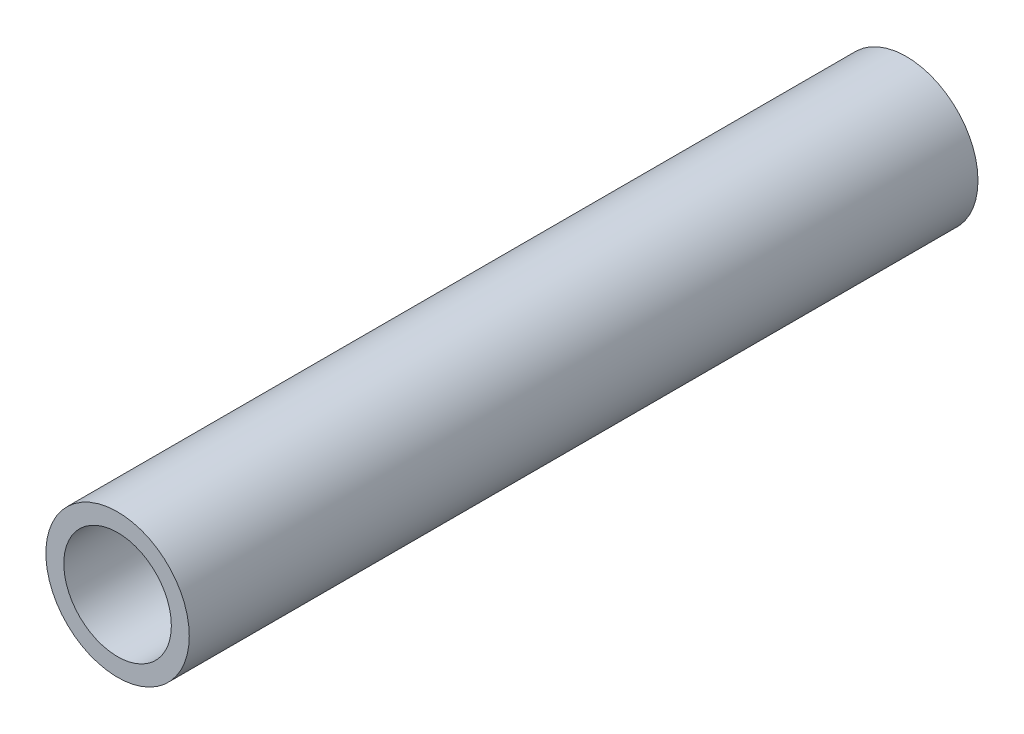
ISO-10303-21;
HEADER;
FILE_DESCRIPTION(('STEP AP214'),'2;1');
FILE_NAME('part.step','',(''),(''),'','','');
FILE_SCHEMA(('AUTOMOTIVE_DESIGN { 1 0 10303 214 1 1 1 1 }'));
ENDSEC;
DATA;
#1=APPLICATION_CONTEXT('core data for automotive mechanical design processes');
#2=APPLICATION_PROTOCOL_DEFINITION('international standard','automotive_design',2000,#1);
#3=PRODUCT_CONTEXT('',#1,'mechanical');
#4=PRODUCT('Part','Part','',(#3));
#5=PRODUCT_RELATED_PRODUCT_CATEGORY('part','',(#4));
#6=PRODUCT_DEFINITION_FORMATION('','',#4);
#7=PRODUCT_DEFINITION_CONTEXT('part definition',#1,'design');
#8=PRODUCT_DEFINITION('design','',#6,#7);
#9=PRODUCT_DEFINITION_SHAPE('','',#8);
#10=(LENGTH_UNIT() NAMED_UNIT(*) SI_UNIT(.MILLI.,.METRE.));
#11=(NAMED_UNIT(*) PLANE_ANGLE_UNIT() SI_UNIT($,.RADIAN.));
#12=(NAMED_UNIT(*) SI_UNIT($,.STERADIAN.) SOLID_ANGLE_UNIT());
#13=UNCERTAINTY_MEASURE_WITH_UNIT(LENGTH_MEASURE(1.E-05),#10,'distance_accuracy_value','');
#14=(GEOMETRIC_REPRESENTATION_CONTEXT(3) GLOBAL_UNCERTAINTY_ASSIGNED_CONTEXT((#13)) GLOBAL_UNIT_ASSIGNED_CONTEXT((#10,
#11,#12)) REPRESENTATION_CONTEXT('',''));
#15=CARTESIAN_POINT('',(0.,0.,0.));
#16=DIRECTION('',(0.,0.,1.));
#17=DIRECTION('',(1.,0.,0.));
#18=AXIS2_PLACEMENT_3D('',#15,#16,#17);
#19=CARTESIAN_POINT('',(0.,0.,34.925));
#20=DIRECTION('',(0.,0.,1.));
#21=DIRECTION('',(1.,0.,0.));
#22=AXIS2_PLACEMENT_3D('',#19,#20,#21);
#23=PLANE('',#22);
#24=CARTESIAN_POINT('',(0.,0.,34.925));
#25=DIRECTION('',(0.,0.,1.));
#26=DIRECTION('',(1.,0.,0.));
#27=AXIS2_PLACEMENT_3D('',#24,#25,#26);
#28=CIRCLE('',#27,6.35);
#29=CARTESIAN_POINT('',(6.35,0.,34.925));
#30=VERTEX_POINT('',#29);
#31=EDGE_CURVE('E10',#30,#30,#28,.T.);
#32=ORIENTED_EDGE('',*,*,#31,.T.);
#33=EDGE_LOOP('',(#32));
#34=FACE_BOUND('',#33,.T.);
#35=CARTESIAN_POINT('',(0.,0.,34.925));
#36=DIRECTION('',(0.,0.,1.));
#37=DIRECTION('',(1.,0.,0.));
#38=AXIS2_PLACEMENT_3D('',#35,#36,#37);
#39=CIRCLE('',#38,4.7625);
#40=CARTESIAN_POINT('',(4.7625,0.,34.925));
#41=VERTEX_POINT('',#40);
#42=EDGE_CURVE('E56',#41,#41,#39,.T.);
#43=ORIENTED_EDGE('',*,*,#42,.F.);
#44=EDGE_LOOP('',(#43));
#45=FACE_BOUND('',#44,.T.);
#46=ADVANCED_FACE('F43',(#34,#45),#23,.T.);
#47=CARTESIAN_POINT('',(0.,0.,-34.925));
#48=DIRECTION('',(0.,0.,1.));
#49=DIRECTION('',(1.,0.,0.));
#50=AXIS2_PLACEMENT_3D('',#47,#48,#49);
#51=PLANE('',#50);
#52=CARTESIAN_POINT('',(0.,0.,-34.925));
#53=DIRECTION('',(0.,0.,1.));
#54=DIRECTION('',(1.,0.,0.));
#55=AXIS2_PLACEMENT_3D('',#52,#53,#54);
#56=CIRCLE('',#55,6.35);
#57=CARTESIAN_POINT('',(6.35,0.,-34.925));
#58=VERTEX_POINT('',#57);
#59=EDGE_CURVE('E47',#58,#58,#56,.T.);
#60=ORIENTED_EDGE('',*,*,#59,.F.);
#61=EDGE_LOOP('',(#60));
#62=FACE_BOUND('',#61,.T.);
#63=CARTESIAN_POINT('',(0.,0.,-34.925));
#64=DIRECTION('',(0.,0.,1.));
#65=DIRECTION('',(1.,0.,0.));
#66=AXIS2_PLACEMENT_3D('',#63,#64,#65);
#67=CIRCLE('',#66,4.7625);
#68=CARTESIAN_POINT('',(4.7625,0.,-34.925));
#69=VERTEX_POINT('',#68);
#70=EDGE_CURVE('E58',#69,#69,#67,.T.);
#71=ORIENTED_EDGE('',*,*,#70,.T.);
#72=EDGE_LOOP('',(#71));
#73=FACE_BOUND('',#72,.T.);
#74=ADVANCED_FACE('F70',(#62,#73),#51,.F.);
#75=CARTESIAN_POINT('',(0.,0.,34.925));
#76=DIRECTION('',(0.,0.,-1.));
#77=DIRECTION('',(-1.,0.,0.));
#78=AXIS2_PLACEMENT_3D('',#75,#76,#77);
#79=CYLINDRICAL_SURFACE('',#78,6.35);
#80=ORIENTED_EDGE('',*,*,#31,.F.);
#81=EDGE_LOOP('',(#80));
#82=FACE_BOUND('',#81,.T.);
#83=ORIENTED_EDGE('',*,*,#59,.T.);
#84=EDGE_LOOP('',(#83));
#85=FACE_BOUND('',#84,.T.);
#86=ADVANCED_FACE('F45',(#82,#85),#79,.T.);
#87=CARTESIAN_POINT('',(0.,0.,34.925));
#88=DIRECTION('',(0.,0.,-1.));
#89=DIRECTION('',(-1.,0.,0.));
#90=AXIS2_PLACEMENT_3D('',#87,#88,#89);
#91=CYLINDRICAL_SURFACE('',#90,4.7625);
#92=ORIENTED_EDGE('',*,*,#42,.T.);
#93=EDGE_LOOP('',(#92));
#94=FACE_BOUND('',#93,.T.);
#95=ORIENTED_EDGE('',*,*,#70,.F.);
#96=EDGE_LOOP('',(#95));
#97=FACE_BOUND('',#96,.T.);
#98=ADVANCED_FACE('F66',(#94,#97),#91,.F.);
#99=CLOSED_SHELL('',(#46,#74,#86,#98));
#100=MANIFOLD_SOLID_BREP('B2',#99);
#101=ADVANCED_BREP_SHAPE_REPRESENTATION('',(#18,#100),#14);
#102=SHAPE_DEFINITION_REPRESENTATION(#9,#101);
ENDSEC;
END-ISO-10303-21;
